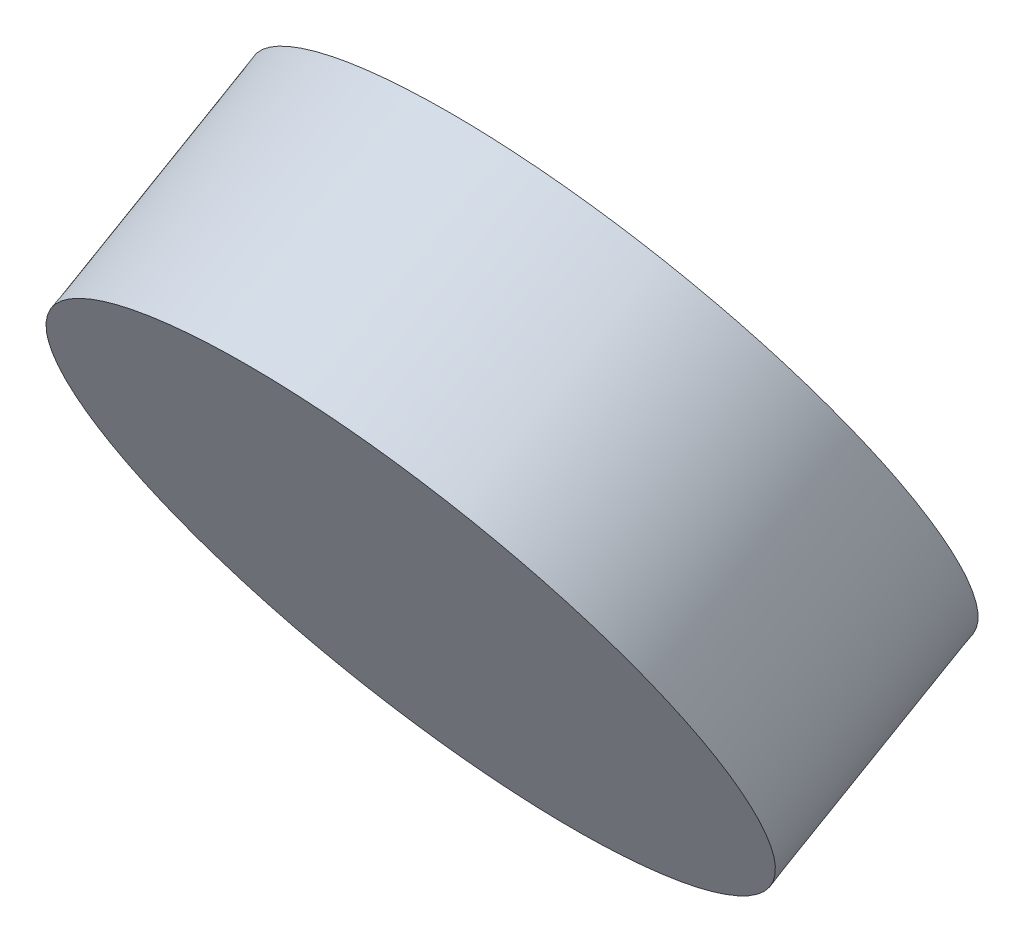
ISO-10303-21;
HEADER;
FILE_DESCRIPTION(('STEP AP214'),'2;1');
FILE_NAME('part.step','',(''),(''),'','','');
FILE_SCHEMA(('AUTOMOTIVE_DESIGN { 1 0 10303 214 1 1 1 1 }'));
ENDSEC;
DATA;
#1=APPLICATION_CONTEXT('core data for automotive mechanical design processes');
#2=APPLICATION_PROTOCOL_DEFINITION('international standard','automotive_design',2000,#1);
#3=PRODUCT_CONTEXT('',#1,'mechanical');
#4=PRODUCT('Part','Part','',(#3));
#5=PRODUCT_RELATED_PRODUCT_CATEGORY('part','',(#4));
#6=PRODUCT_DEFINITION_FORMATION('','',#4);
#7=PRODUCT_DEFINITION_CONTEXT('part definition',#1,'design');
#8=PRODUCT_DEFINITION('design','',#6,#7);
#9=PRODUCT_DEFINITION_SHAPE('','',#8);
#10=(LENGTH_UNIT() NAMED_UNIT(*) SI_UNIT(.MILLI.,.METRE.));
#11=(NAMED_UNIT(*) PLANE_ANGLE_UNIT() SI_UNIT($,.RADIAN.));
#12=(NAMED_UNIT(*) SI_UNIT($,.STERADIAN.) SOLID_ANGLE_UNIT());
#13=UNCERTAINTY_MEASURE_WITH_UNIT(LENGTH_MEASURE(1.E-05),#10,'distance_accuracy_value','');
#14=(GEOMETRIC_REPRESENTATION_CONTEXT(3) GLOBAL_UNCERTAINTY_ASSIGNED_CONTEXT((#13)) GLOBAL_UNIT_ASSIGNED_CONTEXT((#10,
#11,#12)) REPRESENTATION_CONTEXT('',''));
#15=CARTESIAN_POINT('',(0.,0.,0.));
#16=DIRECTION('',(0.,0.,1.));
#17=DIRECTION('',(1.,0.,0.));
#18=AXIS2_PLACEMENT_3D('',#15,#16,#17);
#19=CARTESIAN_POINT('',(-12.5,12.8769058027011,-40.1476192479979));
#20=CARTESIAN_POINT('',(-12.3317700207924,12.8769058027011,-40.1476192479979));
#21=CARTESIAN_POINT('',(-11.9953100623771,12.8189461459482,-40.1810822714263));
#22=CARTESIAN_POINT('',(-11.5674545927316,12.5713634390628,-40.3240242138933));
#23=CARTESIAN_POINT('',(-11.2815707077975,12.2008297332016,-40.5379519487161));
#24=CARTESIAN_POINT('',(-11.1811816375123,11.7637554261858,-40.7902969175275));
#25=CARTESIAN_POINT('',(-11.2815707077975,11.32668111917,-41.042641886339));
#26=CARTESIAN_POINT('',(-11.5674545927316,10.9561474133088,-41.2565696211618));
#27=CARTESIAN_POINT('',(-11.9953100623771,10.7085647064234,-41.3995115636288));
#28=CARTESIAN_POINT('',(-12.5,10.621625221294,-41.4497060987714));
#29=CARTESIAN_POINT('',(-13.0046899376229,10.7085647064234,-41.3995115636288));
#30=CARTESIAN_POINT('',(-13.4325454072684,10.9561474133088,-41.2565696211618));
#31=CARTESIAN_POINT('',(-13.7184292922025,11.32668111917,-41.042641886339));
#32=CARTESIAN_POINT('',(-13.8188183624877,11.7637554261858,-40.7902969175275));
#33=CARTESIAN_POINT('',(-13.7184292922025,12.2008297332016,-40.5379519487161));
#34=CARTESIAN_POINT('',(-13.4325454072684,12.5713634390628,-40.3240242138934));
#35=CARTESIAN_POINT('',(-13.0046899376229,12.8189461459482,-40.1810822714263));
#36=CARTESIAN_POINT('',(-12.6682299792076,12.8769058027011,-40.1476192479979));
#37=CARTESIAN_POINT('',(-12.5,12.8769058027011,-40.1476192479979));
#38=B_SPLINE_CURVE_WITH_KNOTS('',3,(#19,#20,#21,#22,#23,#24,#25,#26,#27,#28,#29,#30,#31,#32,#33,
#34,#35,#36,#37),.UNSPECIFIED.,.T.,.F.,(4,1,1,1,1,1,1,1,1,1,1,1,1,1,1,1,4),(0.,
0.0625000000000001,0.125,0.1875,0.25,0.3125,0.375,0.4375,0.5,0.5625,0.625,0.6875,0.75,0.8125,
0.875,0.9375,1.),.UNSPECIFIED.);
#39=DIRECTION('',(0.,0.499999999999995,-0.866025403784442));
#40=VECTOR('',#39,1.);
#41=SURFACE_OF_LINEAR_EXTRUSION('',#38,#40);
#42=CARTESIAN_POINT('',(-12.5,12.8769058027011,-40.1476192479979));
#43=CARTESIAN_POINT('',(-12.3317700207924,12.8769058027011,-40.1476192479979));
#44=CARTESIAN_POINT('',(-11.9953100623771,12.8189461459482,-40.1810822714263));
#45=CARTESIAN_POINT('',(-11.5674545927316,12.5713634390628,-40.3240242138933));
#46=CARTESIAN_POINT('',(-11.2815707077975,12.2008297332016,-40.5379519487161));
#47=CARTESIAN_POINT('',(-11.1811816375123,11.7637554261858,-40.7902969175275));
#48=CARTESIAN_POINT('',(-11.2815707077975,11.32668111917,-41.042641886339));
#49=CARTESIAN_POINT('',(-11.5674545927316,10.9561474133088,-41.2565696211618));
#50=CARTESIAN_POINT('',(-11.9953100623771,10.7085647064234,-41.3995115636288));
#51=CARTESIAN_POINT('',(-12.5,10.621625221294,-41.4497060987714));
#52=CARTESIAN_POINT('',(-13.0046899376229,10.7085647064234,-41.3995115636288));
#53=CARTESIAN_POINT('',(-13.4325454072684,10.9561474133088,-41.2565696211618));
#54=CARTESIAN_POINT('',(-13.7184292922025,11.32668111917,-41.042641886339));
#55=CARTESIAN_POINT('',(-13.8188183624877,11.7637554261858,-40.7902969175275));
#56=CARTESIAN_POINT('',(-13.7184292922025,12.2008297332016,-40.5379519487161));
#57=CARTESIAN_POINT('',(-13.4325454072684,12.5713634390628,-40.3240242138934));
#58=CARTESIAN_POINT('',(-13.0046899376229,12.8189461459482,-40.1810822714263));
#59=CARTESIAN_POINT('',(-12.6682299792076,12.8769058027011,-40.1476192479979));
#60=CARTESIAN_POINT('',(-12.5,12.8769058027011,-40.1476192479979));
#61=B_SPLINE_CURVE_WITH_KNOTS('',3,(#42,#43,#44,#45,#46,#47,#48,#49,#50,#51,#52,#53,#54,#55,#56,
#57,#58,#59,#60),.UNSPECIFIED.,.T.,.F.,(4,1,1,1,1,1,1,1,1,1,1,1,1,1,1,1,4),(0.,
0.0625000000000001,0.125,0.1875,0.25,0.3125,0.375,0.4375,0.5,0.5625,0.625,0.6875,0.75,0.8125,
0.875,0.9375,1.),.UNSPECIFIED.);
#62=CARTESIAN_POINT('',(-12.5,12.8769058027011,-40.1476192479979));
#63=VERTEX_POINT('',#62);
#64=EDGE_CURVE('E10',#63,#63,#61,.T.);
#65=ORIENTED_EDGE('',*,*,#64,.T.);
#66=EDGE_LOOP('',(#65));
#67=FACE_BOUND('',#66,.T.);
#68=CARTESIAN_POINT('',(-12.5,13.3379679238206,-40.9462022672223));
#69=CARTESIAN_POINT('',(-12.5210292435893,13.3379679370051,-40.9462022596102));
#70=CARTESIAN_POINT('',(-12.5420580506909,13.3375150942108,-40.9464637085194));
#71=CARTESIAN_POINT('',(-12.5840656469514,13.3357124585183,-40.9475044607217));
#72=CARTESIAN_POINT('',(-12.605044433095,13.3343626128516,-40.9482837944807));
#73=CARTESIAN_POINT('',(-12.6469017924796,13.3307746122206,-40.9503553276109));
#74=CARTESIAN_POINT('',(-12.6677803587443,13.328536396298,-40.9516475621763));
#75=CARTESIAN_POINT('',(-12.7093873858979,13.3231802652805,-40.9547399258611));
#76=CARTESIAN_POINT('',(-12.7301158402734,13.3200623122453,-40.9565400768853));
#77=CARTESIAN_POINT('',(-12.7713726611837,13.3129552823521,-40.9606433225072));
#78=CARTESIAN_POINT('',(-12.7919010277185,13.3089662054942,-40.962946417105));
#79=CARTESIAN_POINT('',(-12.832707709252,13.3001254880213,-40.9680506077177));
#80=CARTESIAN_POINT('',(-12.8529860349978,13.2952738846176,-40.9708516822489));
#81=CARTESIAN_POINT('',(-12.8932426430212,13.2847166816437,-40.9769468862278));
#82=CARTESIAN_POINT('',(-12.9132209457939,13.279011140702,-40.9802409818263));
#83=CARTESIAN_POINT('',(-12.9528275830444,13.2667546200185,-40.9873172873423));
#84=CARTESIAN_POINT('',(-12.9724559380415,13.2602036900331,-40.9910994685328));
#85=CARTESIAN_POINT('',(-13.0113124478785,13.2462651035168,-40.9991469152101));
#86=CARTESIAN_POINT('',(-13.0305406027184,13.2388774469859,-41.0034121806969));
#87=CARTESIAN_POINT('',(-13.06855413176,13.2232901029195,-41.0124115379896));
#88=CARTESIAN_POINT('',(-13.0873394798451,13.2150903676354,-41.0171456573631));
#89=CARTESIAN_POINT('',(-13.1244251203754,13.1979034004617,-41.0270685574874));
#90=CARTESIAN_POINT('',(-13.1427253794428,13.1889161145649,-41.0322573694193));
#91=CARTESIAN_POINT('',(-13.1787984767248,13.1701785584249,-41.0430755025006));
#92=CARTESIAN_POINT('',(-13.1965712921558,13.1604282552884,-41.0487048426411));
#93=CARTESIAN_POINT('',(-13.2315471338735,13.1401891460976,-41.0603898977806));
#94=CARTESIAN_POINT('',(-13.2487501601601,13.1297003400433,-41.0664456127796));
#95=CARTESIAN_POINT('',(-13.2825440403118,13.1080086937487,-41.0789692906069));
#96=CARTESIAN_POINT('',(-13.2991349205488,13.0968058843255,-41.0854372356431));
#97=CARTESIAN_POINT('',(-13.331662109414,13.0737107142865,-41.0987712382821));
#98=CARTESIAN_POINT('',(-13.3475984628843,13.0618184010442,-41.1056372685338));
#99=CARTESIAN_POINT('',(-13.3787742546724,13.037368675224,-41.1197533243177));
#100=CARTESIAN_POINT('',(-13.3940137339341,13.0248113018148,-41.1270033272358));
#101=CARTESIAN_POINT('',(-13.4237532190322,12.9990561522244,-41.1418730697849));
#102=CARTESIAN_POINT('',(-13.4382532248685,12.9858583760433,-41.1494928094157));
#103=CARTESIAN_POINT('',(-13.4664853364362,12.9588593483717,-41.1650807053098));
#104=CARTESIAN_POINT('',(-13.4802173969397,12.9450580614227,-41.1730488820449));
#105=CARTESIAN_POINT('',(-13.5068854022177,12.9168886895517,-41.1893124764776));
#106=CARTESIAN_POINT('',(-13.5198212922901,12.9025205657954,-41.197607916596));
#107=CARTESIAN_POINT('',(-13.5448686479447,12.8732542070916,-41.2145048566719));
#108=CARTESIAN_POINT('',(-13.5569800779426,12.8583559493054,-41.2231063698152));
#109=CARTESIAN_POINT('',(-13.5803501882216,12.8280659818592,-41.240594290674));
#110=CARTESIAN_POINT('',(-13.5916088685026,12.8126742721992,-41.2494806983895));
#111=CARTESIAN_POINT('',(-13.6132451346653,12.7814340535596,-41.2675172470306));
#112=CARTESIAN_POINT('',(-13.623622758529,12.7655855643111,-41.2766673765645));
#113=CARTESIAN_POINT('',(-13.6434685587776,12.733468457497,-41.2952101968291));
#114=CARTESIAN_POINT('',(-13.6529367975248,12.7171998688375,-41.304602870871));
#115=CARTESIAN_POINT('',(-13.67093551211,12.6842791869969,-41.3236096353936));
#116=CARTESIAN_POINT('',(-13.6794660430833,12.6676271164334,-41.333223712816));
#117=CARTESIAN_POINT('',(-13.6955609364387,12.6339763918238,-41.3526519677278));
#118=CARTESIAN_POINT('',(-13.7031252988208,12.6169777377776,-41.3624661452172));
#119=CARTESIAN_POINT('',(-13.7172779098496,12.5826773837169,-41.3822694638675));
#120=CARTESIAN_POINT('',(-13.7238661010426,12.5653756659322,-41.392258615288));
#121=CARTESIAN_POINT('',(-13.7360565090117,12.5305124208753,-41.4123869192064));
#122=CARTESIAN_POINT('',(-13.7416586580894,12.5129508758539,-41.4225260819518));
#123=CARTESIAN_POINT('',(-13.7518670392729,12.4776112523987,-41.4429294230667));
#124=CARTESIAN_POINT('',(-13.7564732284109,12.4598331646577,-41.4531936068097));
#125=CARTESIAN_POINT('',(-13.7646797198118,12.4241037119205,-41.4738220159655));
#126=CARTESIAN_POINT('',(-13.7682800220747,12.4061523469245,-41.4841862413783));
#127=CARTESIAN_POINT('',(-13.7744647488583,12.3701195960344,-41.5049897598043));
#128=CARTESIAN_POINT('',(-13.7770492171889,12.3520382157818,-41.5154290495605));
#129=CARTESIAN_POINT('',(-13.7811922856357,12.3157887105628,-41.5363577111566));
#130=CARTESIAN_POINT('',(-13.7827509561402,12.2976205916345,-41.5468470795106));
#131=CARTESIAN_POINT('',(-13.7848324523857,12.2612408291569,-41.5678509451701));
#132=CARTESIAN_POINT('',(-13.7853553390593,12.2430291882311,-41.578365440961));
#133=CARTESIAN_POINT('',(-13.7853553390593,12.2066059063794,-41.5993944325428));
#134=CARTESIAN_POINT('',(-13.7848324523857,12.1883942654536,-41.6099089283338));
#135=CARTESIAN_POINT('',(-13.7827509561402,12.152014502976,-41.6309127939932));
#136=CARTESIAN_POINT('',(-13.7811922856356,12.1338463840476,-41.6414021623472));
#137=CARTESIAN_POINT('',(-13.7770492171888,12.0975968788287,-41.6623308239433));
#138=CARTESIAN_POINT('',(-13.7744647488583,12.0795154985761,-41.6727701136995));
#139=CARTESIAN_POINT('',(-13.7682800220747,12.043482747686,-41.6935736321255));
#140=CARTESIAN_POINT('',(-13.7646797198118,12.0255313826899,-41.7039378575383));
#141=CARTESIAN_POINT('',(-13.7564732284109,11.9898019299528,-41.7245662666941));
#142=CARTESIAN_POINT('',(-13.7518670392729,11.9720238422118,-41.7348304504371));
#143=CARTESIAN_POINT('',(-13.7416586580894,11.9366842187565,-41.755233791552));
#144=CARTESIAN_POINT('',(-13.7360565090117,11.9191226737352,-41.7653729542974));
#145=CARTESIAN_POINT('',(-13.7238661010426,11.8842594286783,-41.7855012582159));
#146=CARTESIAN_POINT('',(-13.7172779098496,11.8669577108936,-41.7954904096364));
#147=CARTESIAN_POINT('',(-13.7031252988208,11.8326573568328,-41.8152937282866));
#148=CARTESIAN_POINT('',(-13.6955609364387,11.8156587027867,-41.825107905776));
#149=CARTESIAN_POINT('',(-13.6794660430833,11.782007978177,-41.8445361606878));
#150=CARTESIAN_POINT('',(-13.67093551211,11.7653559076135,-41.8541502381102));
#151=CARTESIAN_POINT('',(-13.6529367975248,11.7324352257729,-41.8731570026328));
#152=CARTESIAN_POINT('',(-13.6434685587776,11.7161666371135,-41.8825496766747));
#153=CARTESIAN_POINT('',(-13.623622758529,11.6840495302994,-41.9010924969393));
#154=CARTESIAN_POINT('',(-13.6132451346653,11.6682010410509,-41.9102426264732));
#155=CARTESIAN_POINT('',(-13.5916088685026,11.6369608224113,-41.9282791751144));
#156=CARTESIAN_POINT('',(-13.5803501882216,11.6215691127513,-41.9371655828298));
#157=CARTESIAN_POINT('',(-13.5569800779426,11.5912791453051,-41.9546535036886));
#158=CARTESIAN_POINT('',(-13.5448686479447,11.5763808875189,-41.963255016832));
#159=CARTESIAN_POINT('',(-13.5198212922901,11.5471145288151,-41.9801519569078));
#160=CARTESIAN_POINT('',(-13.5068854022177,11.5327464050588,-41.9884473970263));
#161=CARTESIAN_POINT('',(-13.4802173969397,11.5045770331877,-42.0047109914589));
#162=CARTESIAN_POINT('',(-13.4664853364362,11.4907757462388,-42.0126791681941));
#163=CARTESIAN_POINT('',(-13.4382532248685,11.4637767185672,-42.0282670640881));
#164=CARTESIAN_POINT('',(-13.4237532190322,11.4505789423861,-42.035886803719));
#165=CARTESIAN_POINT('',(-13.3940137339341,11.4248237927957,-42.050756546268));
#166=CARTESIAN_POINT('',(-13.3787742546724,11.4122664193865,-42.0580065491862));
#167=CARTESIAN_POINT('',(-13.3475984628843,11.3878166935663,-42.07212260497));
#168=CARTESIAN_POINT('',(-13.331662109414,11.375924380324,-42.0789886352218));
#169=CARTESIAN_POINT('',(-13.2991349205488,11.352829210285,-42.0923226378607));
#170=CARTESIAN_POINT('',(-13.2825440403118,11.3416264008617,-42.098790582897));
#171=CARTESIAN_POINT('',(-13.2487501601601,11.3199347545672,-42.1113142607243));
#172=CARTESIAN_POINT('',(-13.2315471338735,11.3094459485129,-42.1173699757232));
#173=CARTESIAN_POINT('',(-13.1965712921558,11.2892068393221,-42.1290550308627));
#174=CARTESIAN_POINT('',(-13.1787984767249,11.2794565361856,-42.1346843710032));
#175=CARTESIAN_POINT('',(-13.1427253794427,11.2607189800456,-42.1455025040846));
#176=CARTESIAN_POINT('',(-13.1244251203749,11.2517316941488,-42.1506913160164));
#177=CARTESIAN_POINT('',(-13.0873394798455,11.234544726975,-42.1606142161407));
#178=CARTESIAN_POINT('',(-13.0685541317618,11.2263449916909,-42.1653483355143));
#179=CARTESIAN_POINT('',(-13.0305406027166,11.2107576476247,-42.1743476928069));
#180=CARTESIAN_POINT('',(-13.0113124478718,11.203369991094,-42.1786129582936));
#181=CARTESIAN_POINT('',(-12.9724559380482,11.189431404577,-42.1866604049713));
#182=CARTESIAN_POINT('',(-12.9528275830694,11.1828804745907,-42.1904425861623));
#183=CARTESIAN_POINT('',(-12.9132209457689,11.1706239539098,-42.1975188916767));
#184=CARTESIAN_POINT('',(-12.8932426429279,11.1649184129717,-42.2008129872732));
#185=CARTESIAN_POINT('',(-12.8529860350911,11.154361209988,-42.2069081912578));
#186=CARTESIAN_POINT('',(-12.8327077096002,11.1495096065709,-42.2097092657966));
#187=CARTESIAN_POINT('',(-12.7919010273703,11.1406688891345,-42.2148134563883));
#188=CARTESIAN_POINT('',(-12.7713726598844,11.1366798123263,-42.2171165509574));
#189=CARTESIAN_POINT('',(-12.7301158415728,11.1295727822972,-42.2212197966578));
#190=CARTESIAN_POINT('',(-12.7093873907472,11.1264548290763,-42.2230199477892));
#191=CARTESIAN_POINT('',(-12.6677803538952,11.1210986985662,-42.2261123111811));
#192=CARTESIAN_POINT('',(-12.6469017743828,11.1188604833367,-42.2274045453463));
#193=CARTESIAN_POINT('',(-12.6050444511905,11.1152724808121,-42.2294760795697));
#194=CARTESIAN_POINT('',(-12.5840657144826,11.1139226325591,-42.230255414822));
#195=CARTESIAN_POINT('',(-12.5420579831637,11.1121200039326,-42.2312961629447));
#196=CARTESIAN_POINT('',(-12.5210289915818,11.1116671707899,-42.2315576062816));
#197=CARTESIAN_POINT('',(-12.4789710084182,11.1116671707899,-42.2315576062816));
#198=CARTESIAN_POINT('',(-12.4579420168363,11.1121200039326,-42.2312961629447));
#199=CARTESIAN_POINT('',(-12.4159342855174,11.1139226325591,-42.230255414822));
#200=CARTESIAN_POINT('',(-12.3949555488095,11.1152724808121,-42.2294760795697));
#201=CARTESIAN_POINT('',(-12.3530982256172,11.1188604833367,-42.2274045453463));
#202=CARTESIAN_POINT('',(-12.3322196461048,11.1210986985662,-42.2261123111811));
#203=CARTESIAN_POINT('',(-12.2906126092528,11.1264548290763,-42.2230199477892));
#204=CARTESIAN_POINT('',(-12.2698841584272,11.1295727822972,-42.2212197966578));
#205=CARTESIAN_POINT('',(-12.2286273401156,11.1366798123263,-42.2171165509574));
#206=CARTESIAN_POINT('',(-12.2080989726297,11.1406688891345,-42.2148134563883));
#207=CARTESIAN_POINT('',(-12.1672922903998,11.1495096065709,-42.2097092657966));
#208=CARTESIAN_POINT('',(-12.1470139649089,11.154361209988,-42.2069081912578));
#209=CARTESIAN_POINT('',(-12.1067573570721,11.1649184129717,-42.2008129872732));
#210=CARTESIAN_POINT('',(-12.0867790542311,11.1706239539098,-42.1975188916767));
#211=CARTESIAN_POINT('',(-12.0471724169306,11.1828804745907,-42.1904425861623));
#212=CARTESIAN_POINT('',(-12.0275440619518,11.189431404577,-42.1866604049713));
#213=CARTESIAN_POINT('',(-11.9886875521282,11.203369991094,-42.1786129582936));
#214=CARTESIAN_POINT('',(-11.9694593972834,11.2107576476247,-42.1743476928069));
#215=CARTESIAN_POINT('',(-11.9314458682382,11.2263449916909,-42.1653483355143));
#216=CARTESIAN_POINT('',(-11.9126605201545,11.234544726975,-42.1606142161407));
#217=CARTESIAN_POINT('',(-11.8755748796251,11.2517316941488,-42.1506913160164));
#218=CARTESIAN_POINT('',(-11.8572746205573,11.2607189800456,-42.1455025040846));
#219=CARTESIAN_POINT('',(-11.8212015232751,11.2794565361856,-42.1346843710032));
#220=CARTESIAN_POINT('',(-11.8034287078442,11.2892068393221,-42.1290550308627));
#221=CARTESIAN_POINT('',(-11.7684528661265,11.3094459485129,-42.1173699757232));
#222=CARTESIAN_POINT('',(-11.7512498398399,11.3199347545672,-42.1113142607243));
#223=CARTESIAN_POINT('',(-11.7174559596882,11.3416264008617,-42.098790582897));
#224=CARTESIAN_POINT('',(-11.7008650794512,11.352829210285,-42.0923226378607));
#225=CARTESIAN_POINT('',(-11.668337890586,11.375924380324,-42.0789886352218));
#226=CARTESIAN_POINT('',(-11.6524015371157,11.3878166935663,-42.07212260497));
#227=CARTESIAN_POINT('',(-11.6212257453276,11.4122664193864,-42.0580065491862));
#228=CARTESIAN_POINT('',(-11.6059862660658,11.4248237927957,-42.050756546268));
#229=CARTESIAN_POINT('',(-11.5762467809678,11.4505789423861,-42.035886803719));
#230=CARTESIAN_POINT('',(-11.5617467751315,11.4637767185672,-42.0282670640881));
#231=CARTESIAN_POINT('',(-11.5335146635638,11.4907757462388,-42.0126791681941));
#232=CARTESIAN_POINT('',(-11.5197826030603,11.5045770331877,-42.0047109914589));
#233=CARTESIAN_POINT('',(-11.4931145977823,11.5327464050588,-41.9884473970263));
#234=CARTESIAN_POINT('',(-11.4801787077099,11.5471145288151,-41.9801519569078));
#235=CARTESIAN_POINT('',(-11.4551313520553,11.5763808875189,-41.963255016832));
#236=CARTESIAN_POINT('',(-11.4430199220574,11.5912791453051,-41.9546535036886));
#237=CARTESIAN_POINT('',(-11.4196498117784,11.6215691127513,-41.9371655828298));
#238=CARTESIAN_POINT('',(-11.4083911314973,11.6369608224113,-41.9282791751144));
#239=CARTESIAN_POINT('',(-11.3867548653347,11.6682010410509,-41.9102426264732));
#240=CARTESIAN_POINT('',(-11.376377241471,11.6840495302994,-41.9010924969393));
#241=CARTESIAN_POINT('',(-11.3565314412224,11.7161666371135,-41.8825496766747));
#242=CARTESIAN_POINT('',(-11.3470632024752,11.7324352257729,-41.8731570026328));
#243=CARTESIAN_POINT('',(-11.32906448789,11.7653559076135,-41.8541502381102));
#244=CARTESIAN_POINT('',(-11.3205339569167,11.782007978177,-41.8445361606878));
#245=CARTESIAN_POINT('',(-11.3044390635613,11.8156587027867,-41.825107905776));
#246=CARTESIAN_POINT('',(-11.2968747011792,11.8326573568328,-41.8152937282866));
#247=CARTESIAN_POINT('',(-11.2827220901504,11.8669577108936,-41.7954904096364));
#248=CARTESIAN_POINT('',(-11.2761338989574,11.8842594286783,-41.7855012582159));
#249=CARTESIAN_POINT('',(-11.2639434909883,11.9191226737352,-41.7653729542975));
#250=CARTESIAN_POINT('',(-11.2583413419106,11.9366842187565,-41.755233791552));
#251=CARTESIAN_POINT('',(-11.2481329607271,11.9720238422118,-41.7348304504371));
#252=CARTESIAN_POINT('',(-11.2435267715891,11.9898019299528,-41.7245662666941));
#253=CARTESIAN_POINT('',(-11.2353202801882,12.0255313826899,-41.7039378575383));
#254=CARTESIAN_POINT('',(-11.2317199779253,12.043482747686,-41.6935736321255));
#255=CARTESIAN_POINT('',(-11.2255352511416,12.0795154985761,-41.6727701136995));
#256=CARTESIAN_POINT('',(-11.2229507828111,12.0975968788287,-41.6623308239433));
#257=CARTESIAN_POINT('',(-11.2188077143643,12.1338463840476,-41.6414021623472));
#258=CARTESIAN_POINT('',(-11.2172490438598,12.152014502976,-41.6309127939932));
#259=CARTESIAN_POINT('',(-11.2151675476143,12.1883942654536,-41.6099089283338));
#260=CARTESIAN_POINT('',(-11.2146446609407,12.2066059063794,-41.5993944325428));
#261=CARTESIAN_POINT('',(-11.2146446609407,12.2430291882311,-41.578365440961));
#262=CARTESIAN_POINT('',(-11.2151675476143,12.2612408291569,-41.5678509451701));
#263=CARTESIAN_POINT('',(-11.2172490438598,12.2976205916345,-41.5468470795106));
#264=CARTESIAN_POINT('',(-11.2188077143643,12.3157887105628,-41.5363577111566));
#265=CARTESIAN_POINT('',(-11.2229507828111,12.3520382157818,-41.5154290495605));
#266=CARTESIAN_POINT('',(-11.2255352511416,12.3701195960344,-41.5049897598043));
#267=CARTESIAN_POINT('',(-11.2317199779253,12.4061523469245,-41.4841862413783));
#268=CARTESIAN_POINT('',(-11.2353202801882,12.4241037119205,-41.4738220159655));
#269=CARTESIAN_POINT('',(-11.2435267715891,12.4598331646577,-41.4531936068097));
#270=CARTESIAN_POINT('',(-11.2481329607271,12.4776112523987,-41.4429294230667));
#271=CARTESIAN_POINT('',(-11.2583413419106,12.5129508758539,-41.4225260819518));
#272=CARTESIAN_POINT('',(-11.2639434909883,12.5305124208753,-41.4123869192064));
#273=CARTESIAN_POINT('',(-11.2761338989574,12.5653756659322,-41.392258615288));
#274=CARTESIAN_POINT('',(-11.2827220901504,12.5826773837169,-41.3822694638675));
#275=CARTESIAN_POINT('',(-11.2968747011792,12.6169777377776,-41.3624661452172));
#276=CARTESIAN_POINT('',(-11.3044390635613,12.6339763918238,-41.3526519677278));
#277=CARTESIAN_POINT('',(-11.3205339569167,12.6676271164334,-41.333223712816));
#278=CARTESIAN_POINT('',(-11.32906448789,12.6842791869969,-41.3236096353936));
#279=CARTESIAN_POINT('',(-11.3470632024752,12.7171998688375,-41.304602870871));
#280=CARTESIAN_POINT('',(-11.3565314412224,12.733468457497,-41.2952101968292));
#281=CARTESIAN_POINT('',(-11.376377241471,12.7655855643111,-41.2766673765645));
#282=CARTESIAN_POINT('',(-11.3867548653347,12.7814340535596,-41.2675172470306));
#283=CARTESIAN_POINT('',(-11.4083911314974,12.8126742721992,-41.2494806983895));
#284=CARTESIAN_POINT('',(-11.4196498117784,12.8280659818592,-41.240594290674));
#285=CARTESIAN_POINT('',(-11.4430199220574,12.8583559493054,-41.2231063698152));
#286=CARTESIAN_POINT('',(-11.4551313520553,12.8732542070916,-41.2145048566719));
#287=CARTESIAN_POINT('',(-11.4801787077099,12.9025205657954,-41.197607916596));
#288=CARTESIAN_POINT('',(-11.4931145977823,12.9168886895517,-41.1893124764775));
#289=CARTESIAN_POINT('',(-11.5197826030603,12.9450580614227,-41.1730488820449));
#290=CARTESIAN_POINT('',(-11.5335146635638,12.9588593483717,-41.1650807053098));
#291=CARTESIAN_POINT('',(-11.5617467751315,12.9858583760433,-41.1494928094157));
#292=CARTESIAN_POINT('',(-11.5762467809678,12.9990561522244,-41.1418730697849));
#293=CARTESIAN_POINT('',(-11.6059862660659,13.0248113018148,-41.1270033272358));
#294=CARTESIAN_POINT('',(-11.6212257453276,13.037368675224,-41.1197533243177));
#295=CARTESIAN_POINT('',(-11.6524015371157,13.0618184010442,-41.1056372685338));
#296=CARTESIAN_POINT('',(-11.668337890586,13.0737107142865,-41.0987712382821));
#297=CARTESIAN_POINT('',(-11.7008650794512,13.0968058843255,-41.0854372356431));
#298=CARTESIAN_POINT('',(-11.7174559596882,13.1080086937487,-41.0789692906069));
#299=CARTESIAN_POINT('',(-11.7512498398399,13.1297003400433,-41.0664456127795));
#300=CARTESIAN_POINT('',(-11.7684528661265,13.1401891460976,-41.0603898977806));
#301=CARTESIAN_POINT('',(-11.8034287078442,13.1604282552884,-41.0487048426411));
#302=CARTESIAN_POINT('',(-11.8212015232752,13.1701785584249,-41.0430755025006));
#303=CARTESIAN_POINT('',(-11.8572746205572,13.1889161145649,-41.0322573694192));
#304=CARTESIAN_POINT('',(-11.8755748796246,13.1979034004617,-41.0270685574874));
#305=CARTESIAN_POINT('',(-11.9126605201549,13.2150903676354,-41.0171456573631));
#306=CARTESIAN_POINT('',(-11.93144586824,13.2232901029195,-41.0124115379896));
#307=CARTESIAN_POINT('',(-11.9694593972816,13.2388774469859,-41.0034121806969));
#308=CARTESIAN_POINT('',(-11.9886875521215,13.2462651035168,-40.9991469152101));
#309=CARTESIAN_POINT('',(-12.0275440619585,13.2602036900331,-40.9910994685328));
#310=CARTESIAN_POINT('',(-12.0471724169556,13.2667546200185,-40.9873172873423));
#311=CARTESIAN_POINT('',(-12.0867790542061,13.279011140702,-40.9802409818263));
#312=CARTESIAN_POINT('',(-12.1067573569788,13.2847166816437,-40.9769468862278));
#313=CARTESIAN_POINT('',(-12.1470139650022,13.2952738846176,-40.9708516822489));
#314=CARTESIAN_POINT('',(-12.167292290748,13.3001254880213,-40.9680506077177));
#315=CARTESIAN_POINT('',(-12.2080989722815,13.3089662054942,-40.962946417105));
#316=CARTESIAN_POINT('',(-12.2286273388163,13.3129552823521,-40.9606433225072));
#317=CARTESIAN_POINT('',(-12.2698841597265,13.3200623122453,-40.9565400768853));
#318=CARTESIAN_POINT('',(-12.2906126141021,13.3231802652805,-40.9547399258611));
#319=CARTESIAN_POINT('',(-12.3322196412557,13.328536396298,-40.9516475621763));
#320=CARTESIAN_POINT('',(-12.3530982075204,13.3307746122206,-40.9503553276109));
#321=CARTESIAN_POINT('',(-12.394955566905,13.3343626128516,-40.9482837944807));
#322=CARTESIAN_POINT('',(-12.4159343530485,13.3357124585183,-40.9475044607217));
#323=CARTESIAN_POINT('',(-12.4579419493091,13.3375150942108,-40.9464637085194));
#324=CARTESIAN_POINT('',(-12.4789707564107,13.3379679370051,-40.9462022596102));
#325=CARTESIAN_POINT('',(-12.5,13.3379679238206,-40.9462022672223));
#326=B_SPLINE_CURVE_WITH_KNOTS('',3,(#68,#69,#70,#71,#72,#73,#74,#75,#76,#77,#78,#79,#80,#81,
#82,#83,#84,#85,#86,#87,#88,#89,#90,#91,#92,#93,#94,#95,#96,#97,#98,#99,#100,#101,#102,#103,
#104,#105,#106,#107,#108,#109,#110,#111,#112,#113,#114,#115,#116,#117,#118,#119,#120,#121,#122,
#123,#124,#125,#126,#127,#128,#129,#130,#131,#132,#133,#134,#135,#136,#137,#138,#139,#140,#141,
#142,#143,#144,#145,#146,#147,#148,#149,#150,#151,#152,#153,#154,#155,#156,#157,#158,#159,#160,
#161,#162,#163,#164,#165,#166,#167,#168,#169,#170,#171,#172,#173,#174,#175,#176,#177,#178,#179,
#180,#181,#182,#183,#184,#185,#186,#187,#188,#189,#190,#191,#192,#193,#194,#195,#196,#197,#198,
#199,#200,#201,#202,#203,#204,#205,#206,#207,#208,#209,#210,#211,#212,#213,#214,#215,#216,#217,
#218,#219,#220,#221,#222,#223,#224,#225,#226,#227,#228,#229,#230,#231,#232,#233,#234,#235,#236,
#237,#238,#239,#240,#241,#242,#243,#244,#245,#246,#247,#248,#249,#250,#251,#252,#253,#254,#255,
#256,#257,#258,#259,#260,#261,#262,#263,#264,#265,#266,#267,#268,#269,#270,#271,#272,#273,#274,
#275,#276,#277,#278,#279,#280,#281,#282,#283,#284,#285,#286,#287,#288,#289,#290,#291,#292,#293,
#294,#295,#296,#297,#298,#299,#300,#301,#302,#303,#304,#305,#306,#307,#308,#309,#310,#311,#312,
#313,#314,#315,#316,#317,#318,#319,#320,#321,#322,#323,#324,#325),.UNSPECIFIED.,.F.,.F.,(4,2,2,
2,2,2,2,2,2,2,2,2,2,2,2,2,2,2,2,2,2,2,2,2,2,2,2,2,2,2,2,2,2,2,2,2,2,2,2,2,2,2,2,2,2,2,2,2,2,2,2,
2,2,2,2,2,2,2,2,2,2,2,2,2,2,2,2,2,2,2,2,2,2,2,2,2,2,2,2,2,2,2,2,2,2,2,2,2,2,2,2,2,2,2,2,2,2,2,2,
2,2,2,2,2,2,2,2,2,2,2,2,2,2,2,2,2,2,2,2,2,2,2,2,2,2,2,2,2,4),(0.,0.0630806127990793,
0.126164936809588,0.189253590290846,0.252344965001654,0.315436339712459,0.378524993193717,
0.441609317204224,0.504689930003307,0.567770542802381,0.63085486681289,0.693943520294152,
0.757034895004957,0.820126269715767,0.883214923197022,0.946299247207534,1.00937986000661,
1.07246047280569,1.1355447968162,1.19863345029746,1.26172482500827,1.32481619971907,
1.38790485320033,1.45098917721083,1.51406979000991,1.57715040280899,1.6402347268195,
1.70332338030076,1.76641475501156,1.82950612972237,1.89259478320363,1.95567910721414,
2.01875972001322,2.0818403328123,2.14492465682281,2.20801331030406,2.27110468501487,
2.33419605972568,2.39728471320693,2.46036903721745,2.52344965001652,2.5865302628156,
2.64961458682611,2.71270324030737,2.77579461501818,2.83888598972898,2.90197464321024,
2.96505896722075,3.02813958001983,3.09122019281891,3.15430451682942,3.21739317031067,
3.28048454502148,3.34357591973229,3.40666457321355,3.46974889722406,3.53282951002314,
3.59591012282221,3.65899444683272,3.72208310031398,3.78517447502479,3.84826584973559,
3.91135450321685,3.97443882722736,4.03751944002644,4.10060005282552,4.16368437683603,
4.22677303031729,4.28986440502809,4.3529557797389,4.41604443322016,4.47912875723067,
4.54220937002975,4.60528998282882,4.66837430683933,4.73146296032059,4.7945543350314,
4.8576457097422,4.92073436322346,4.98381868723397,5.04689930003305,5.10997991283213,
5.17306423684264,5.2361528903239,5.2992442650347,5.36233563974551,5.42542429322677,
5.48850861723728,5.55158923003635,5.61466984283543,5.67775416684594,5.7408428203272,
5.803934195038,5.86702556974881,5.93011422323007,5.99319854724058,6.05627916003966,
6.11935977283873,6.18244409684925,6.24553275033051,6.30862412504131,6.37171549975212,
6.43480415323337,6.49788847724389,6.56096909004296,6.62404970284204,6.68713402685255,
6.75022268033381,6.81331405504462,6.87640542975543,6.93949408323668,7.00257840724719,
7.06565902004627,7.12873963284535,7.19182395685586,7.25491261033712,7.31800398504792,
7.38109535975873,7.44418401323998,7.50726833725049,7.57034895004957,7.63342956284865,
7.69651388685916,7.75960254034042,7.82269391505122,7.88578528976203,7.94887394324329,
8.0119582672538,8.07503888005288),.UNSPECIFIED.);
#327=CARTESIAN_POINT('',(-12.5,13.3379679238206,-40.9462022672223));
#328=VERTEX_POINT('',#327);
#329=EDGE_CURVE('E25',#328,#328,#326,.F.);
#330=ORIENTED_EDGE('',*,*,#329,.F.);
#331=EDGE_LOOP('',(#330));
#332=FACE_BOUND('',#331,.T.);
#333=ADVANCED_FACE('F15',(#67,#332),#41,.T.);
#334=CARTESIAN_POINT('',(-13.7495895873013,0.969446630382925,-47.0223940065002));
#335=DIRECTION('',(0.,0.499999999999995,-0.866025403784442));
#336=DIRECTION('',(-1.,0.,0.));
#337=AXIS2_PLACEMENT_3D('',#334,#335,#336);
#338=PLANE('',#337);
#339=ORIENTED_EDGE('',*,*,#64,.F.);
#340=EDGE_LOOP('',(#339));
#341=FACE_BOUND('',#340,.T.);
#342=ADVANCED_FACE('F63',(#341),#338,.F.);
#343=CARTESIAN_POINT('',(-13.7495895873013,1.43050875150237,-47.8209770257246));
#344=DIRECTION('',(0.,0.499999999999995,-0.866025403784442));
#345=DIRECTION('',(-1.,0.,0.));
#346=AXIS2_PLACEMENT_3D('',#343,#344,#345);
#347=PLANE('',#346);
#348=ORIENTED_EDGE('',*,*,#329,.T.);
#349=EDGE_LOOP('',(#348));
#350=FACE_BOUND('',#349,.T.);
#351=ADVANCED_FACE('F32',(#350),#347,.T.);
#352=CLOSED_SHELL('',(#333,#342,#351));
#353=MANIFOLD_SOLID_BREP('B1',#352);
#354=ADVANCED_BREP_SHAPE_REPRESENTATION('',(#18,#353),#14);
#355=SHAPE_DEFINITION_REPRESENTATION(#9,#354);
ENDSEC;
END-ISO-10303-21;
